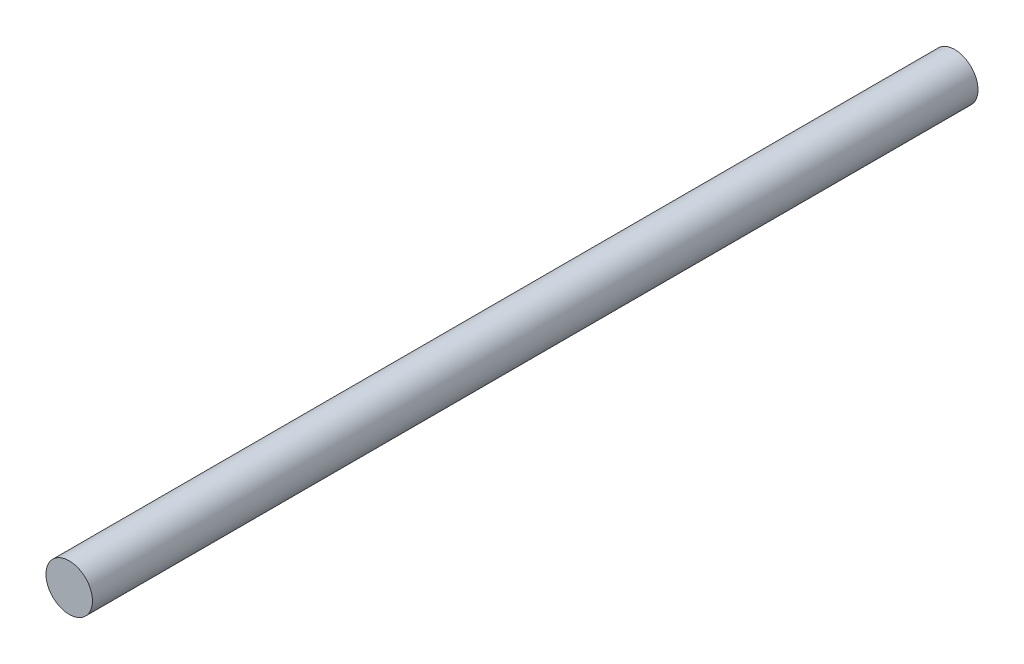
ISO-10303-21;
HEADER;
FILE_DESCRIPTION(('STEP AP214'),'2;1');
FILE_NAME('part.step','',(''),(''),'','','');
FILE_SCHEMA(('AUTOMOTIVE_DESIGN { 1 0 10303 214 1 1 1 1 }'));
ENDSEC;
DATA;
#1=APPLICATION_CONTEXT('core data for automotive mechanical design processes');
#2=APPLICATION_PROTOCOL_DEFINITION('international standard','automotive_design',2000,#1);
#3=PRODUCT_CONTEXT('',#1,'mechanical');
#4=PRODUCT('Part','Part','',(#3));
#5=PRODUCT_RELATED_PRODUCT_CATEGORY('part','',(#4));
#6=PRODUCT_DEFINITION_FORMATION('','',#4);
#7=PRODUCT_DEFINITION_CONTEXT('part definition',#1,'design');
#8=PRODUCT_DEFINITION('design','',#6,#7);
#9=PRODUCT_DEFINITION_SHAPE('','',#8);
#10=(LENGTH_UNIT() NAMED_UNIT(*) SI_UNIT(.MILLI.,.METRE.));
#11=(NAMED_UNIT(*) PLANE_ANGLE_UNIT() SI_UNIT($,.RADIAN.));
#12=(NAMED_UNIT(*) SI_UNIT($,.STERADIAN.) SOLID_ANGLE_UNIT());
#13=UNCERTAINTY_MEASURE_WITH_UNIT(LENGTH_MEASURE(1.E-05),#10,'distance_accuracy_value','');
#14=(GEOMETRIC_REPRESENTATION_CONTEXT(3) GLOBAL_UNCERTAINTY_ASSIGNED_CONTEXT((#13)) GLOBAL_UNIT_ASSIGNED_CONTEXT((#10,
#11,#12)) REPRESENTATION_CONTEXT('',''));
#15=CARTESIAN_POINT('',(0.,0.,0.));
#16=DIRECTION('',(0.,0.,1.));
#17=DIRECTION('',(1.,0.,0.));
#18=AXIS2_PLACEMENT_3D('',#15,#16,#17);
#19=CARTESIAN_POINT('',(0.,0.,80.));
#20=DIRECTION('',(0.,0.,-1.));
#21=DIRECTION('',(-1.,0.,0.));
#22=AXIS2_PLACEMENT_3D('',#19,#20,#21);
#23=CYLINDRICAL_SURFACE('',#22,2.1);
#24=CARTESIAN_POINT('',(0.,0.,80.));
#25=DIRECTION('',(0.,0.,1.));
#26=DIRECTION('',(1.,0.,0.));
#27=AXIS2_PLACEMENT_3D('',#24,#25,#26);
#28=CIRCLE('',#27,2.1);
#29=CARTESIAN_POINT('',(2.1,0.,80.));
#30=VERTEX_POINT('',#29);
#31=EDGE_CURVE('E10',#30,#30,#28,.T.);
#32=ORIENTED_EDGE('',*,*,#31,.F.);
#33=EDGE_LOOP('',(#32));
#34=FACE_BOUND('',#33,.T.);
#35=CARTESIAN_POINT('',(0.,0.,0.));
#36=DIRECTION('',(0.,0.,1.));
#37=DIRECTION('',(1.,0.,0.));
#38=AXIS2_PLACEMENT_3D('',#35,#36,#37);
#39=CIRCLE('',#38,2.1);
#40=CARTESIAN_POINT('',(2.1,0.,0.));
#41=VERTEX_POINT('',#40);
#42=EDGE_CURVE('E40',#41,#41,#39,.T.);
#43=ORIENTED_EDGE('',*,*,#42,.T.);
#44=EDGE_LOOP('',(#43));
#45=FACE_BOUND('',#44,.T.);
#46=ADVANCED_FACE('F37',(#34,#45),#23,.T.);
#47=CARTESIAN_POINT('',(0.,0.,80.));
#48=DIRECTION('',(0.,0.,1.));
#49=DIRECTION('',(1.,0.,0.));
#50=AXIS2_PLACEMENT_3D('',#47,#48,#49);
#51=PLANE('',#50);
#52=ORIENTED_EDGE('',*,*,#31,.T.);
#53=EDGE_LOOP('',(#52));
#54=FACE_BOUND('',#53,.T.);
#55=ADVANCED_FACE('F54',(#54),#51,.T.);
#56=CARTESIAN_POINT('',(0.,0.,0.));
#57=DIRECTION('',(0.,0.,1.));
#58=DIRECTION('',(1.,0.,0.));
#59=AXIS2_PLACEMENT_3D('',#56,#57,#58);
#60=PLANE('',#59);
#61=ORIENTED_EDGE('',*,*,#42,.F.);
#62=EDGE_LOOP('',(#61));
#63=FACE_BOUND('',#62,.T.);
#64=ADVANCED_FACE('F52',(#63),#60,.F.);
#65=CLOSED_SHELL('',(#46,#55,#64));
#66=MANIFOLD_SOLID_BREP('B2',#65);
#67=ADVANCED_BREP_SHAPE_REPRESENTATION('',(#18,#66),#14);
#68=SHAPE_DEFINITION_REPRESENTATION(#9,#67);
ENDSEC;
END-ISO-10303-21;
